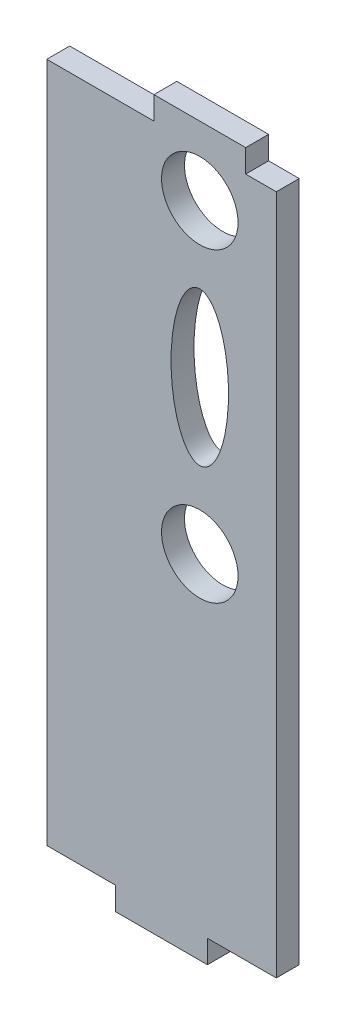
ISO-10303-21;
HEADER;
FILE_DESCRIPTION(('STEP AP214'),'2;1');
FILE_NAME('part.step','',(''),(''),'','','');
FILE_SCHEMA(('AUTOMOTIVE_DESIGN { 1 0 10303 214 1 1 1 1 }'));
ENDSEC;
DATA;
#1=APPLICATION_CONTEXT('core data for automotive mechanical design processes');
#2=APPLICATION_PROTOCOL_DEFINITION('international standard','automotive_design',2000,#1);
#3=PRODUCT_CONTEXT('',#1,'mechanical');
#4=PRODUCT('Part','Part','',(#3));
#5=PRODUCT_RELATED_PRODUCT_CATEGORY('part','',(#4));
#6=PRODUCT_DEFINITION_FORMATION('','',#4);
#7=PRODUCT_DEFINITION_CONTEXT('part definition',#1,'design');
#8=PRODUCT_DEFINITION('design','',#6,#7);
#9=PRODUCT_DEFINITION_SHAPE('','',#8);
#10=(LENGTH_UNIT() NAMED_UNIT(*) SI_UNIT(.MILLI.,.METRE.));
#11=(NAMED_UNIT(*) PLANE_ANGLE_UNIT() SI_UNIT($,.RADIAN.));
#12=(NAMED_UNIT(*) SI_UNIT($,.STERADIAN.) SOLID_ANGLE_UNIT());
#13=UNCERTAINTY_MEASURE_WITH_UNIT(LENGTH_MEASURE(1.E-05),#10,'distance_accuracy_value','');
#14=(GEOMETRIC_REPRESENTATION_CONTEXT(3) GLOBAL_UNCERTAINTY_ASSIGNED_CONTEXT((#13)) GLOBAL_UNIT_ASSIGNED_CONTEXT((#10,
#11,#12)) REPRESENTATION_CONTEXT('',''));
#15=CARTESIAN_POINT('',(0.,0.,0.));
#16=DIRECTION('',(0.,0.,1.));
#17=DIRECTION('',(1.,0.,0.));
#18=AXIS2_PLACEMENT_3D('',#15,#16,#17);
#19=CARTESIAN_POINT('',(0.,0.,3.));
#20=DIRECTION('',(0.,0.,1.));
#21=DIRECTION('',(1.,0.,0.));
#22=AXIS2_PLACEMENT_3D('',#19,#20,#21);
#23=PLANE('',#22);
#24=CARTESIAN_POINT('',(575.166453787392,349.688275275402,3.));
#25=DIRECTION('',(0.,0.,1.));
#26=DIRECTION('',(1.,0.,0.));
#27=AXIS2_PLACEMENT_3D('',#24,#25,#26);
#28=CIRCLE('',#27,5.00000000000005);
#29=CARTESIAN_POINT('',(580.166453787392,349.688275275402,3.));
#30=VERTEX_POINT('',#29);
#31=EDGE_CURVE('E283',#30,#30,#28,.T.);
#32=ORIENTED_EDGE('',*,*,#31,.F.);
#33=EDGE_LOOP('',(#32));
#34=FACE_BOUND('',#33,.T.);
#35=DIRECTION('',(-1.,0.,0.));
#36=VECTOR('',#35,1.);
#37=CARTESIAN_POINT('',(555.166453787392,395.688275275402,3.));
#38=LINE('',#37,#36);
#39=CARTESIAN_POINT('',(569.166453787392,395.688275275402,3.));
#40=VERTEX_POINT('',#39);
#41=CARTESIAN_POINT('',(555.166453787392,395.688275275402,3.));
#42=VERTEX_POINT('',#41);
#43=EDGE_CURVE('E179',#40,#42,#38,.T.);
#44=ORIENTED_EDGE('',*,*,#43,.T.);
#45=DIRECTION('',(0.,-1.,0.));
#46=VECTOR('',#45,1.);
#47=CARTESIAN_POINT('',(555.166453787392,395.688275275402,3.));
#48=LINE('',#47,#46);
#49=CARTESIAN_POINT('',(555.166453787392,306.688275275402,3.));
#50=VERTEX_POINT('',#49);
#51=EDGE_CURVE('E107',#42,#50,#48,.T.);
#52=ORIENTED_EDGE('',*,*,#51,.T.);
#53=DIRECTION('',(1.,0.,0.));
#54=VECTOR('',#53,1.);
#55=CARTESIAN_POINT('',(555.166453787392,306.688275275402,3.));
#56=LINE('',#55,#54);
#57=CARTESIAN_POINT('',(564.166453787392,306.688275275402,3.));
#58=VERTEX_POINT('',#57);
#59=EDGE_CURVE('E206',#50,#58,#56,.T.);
#60=ORIENTED_EDGE('',*,*,#59,.T.);
#61=DIRECTION('',(0.,-1.,0.));
#62=VECTOR('',#61,1.);
#63=CARTESIAN_POINT('',(564.166453787392,303.688275275402,3.));
#64=LINE('',#63,#62);
#65=CARTESIAN_POINT('',(564.166453787392,303.688275275402,3.));
#66=VERTEX_POINT('',#65);
#67=EDGE_CURVE('E225',#58,#66,#64,.T.);
#68=ORIENTED_EDGE('',*,*,#67,.T.);
#69=DIRECTION('',(1.,0.,0.));
#70=VECTOR('',#69,1.);
#71=CARTESIAN_POINT('',(564.166453787392,303.688275275402,3.));
#72=LINE('',#71,#70);
#73=CARTESIAN_POINT('',(576.166453787392,303.688275275402,3.));
#74=VERTEX_POINT('',#73);
#75=EDGE_CURVE('E222',#66,#74,#72,.T.);
#76=ORIENTED_EDGE('',*,*,#75,.T.);
#77=DIRECTION('',(0.,1.,0.));
#78=VECTOR('',#77,1.);
#79=CARTESIAN_POINT('',(576.166453787392,303.688275275402,3.));
#80=LINE('',#79,#78);
#81=CARTESIAN_POINT('',(576.166453787392,306.688275275402,3.));
#82=VERTEX_POINT('',#81);
#83=EDGE_CURVE('E224',#74,#82,#80,.T.);
#84=ORIENTED_EDGE('',*,*,#83,.T.);
#85=DIRECTION('',(1.,0.,0.));
#86=VECTOR('',#85,1.);
#87=CARTESIAN_POINT('',(576.166453787392,306.688275275402,3.));
#88=LINE('',#87,#86);
#89=CARTESIAN_POINT('',(585.166453787392,306.688275275402,3.));
#90=VERTEX_POINT('',#89);
#91=EDGE_CURVE('E227',#82,#90,#88,.T.);
#92=ORIENTED_EDGE('',*,*,#91,.T.);
#93=DIRECTION('',(0.,1.,0.));
#94=VECTOR('',#93,1.);
#95=CARTESIAN_POINT('',(585.166453787392,395.688275275402,3.));
#96=LINE('',#95,#94);
#97=CARTESIAN_POINT('',(585.166453787392,395.688275275402,3.));
#98=VERTEX_POINT('',#97);
#99=EDGE_CURVE('E233',#90,#98,#96,.T.);
#100=ORIENTED_EDGE('',*,*,#99,.T.);
#101=DIRECTION('',(-1.,0.,0.));
#102=VECTOR('',#101,1.);
#103=CARTESIAN_POINT('',(581.166453787392,395.688275275402,3.));
#104=LINE('',#103,#102);
#105=CARTESIAN_POINT('',(581.166453787392,395.688275275402,3.));
#106=VERTEX_POINT('',#105);
#107=EDGE_CURVE('E138',#98,#106,#104,.T.);
#108=ORIENTED_EDGE('',*,*,#107,.T.);
#109=DIRECTION('',(0.,1.,0.));
#110=VECTOR('',#109,1.);
#111=CARTESIAN_POINT('',(581.166453787392,395.688275275402,3.));
#112=LINE('',#111,#110);
#113=CARTESIAN_POINT('',(581.166453787392,398.688275275402,3.));
#114=VERTEX_POINT('',#113);
#115=EDGE_CURVE('E132',#106,#114,#112,.T.);
#116=ORIENTED_EDGE('',*,*,#115,.T.);
#117=DIRECTION('',(-1.,0.,0.));
#118=VECTOR('',#117,1.);
#119=CARTESIAN_POINT('',(569.166453787392,398.688275275402,3.));
#120=LINE('',#119,#118);
#121=CARTESIAN_POINT('',(569.166453787392,398.688275275402,3.));
#122=VERTEX_POINT('',#121);
#123=EDGE_CURVE('E136',#114,#122,#120,.T.);
#124=ORIENTED_EDGE('',*,*,#123,.T.);
#125=DIRECTION('',(0.,-1.,0.));
#126=VECTOR('',#125,1.);
#127=CARTESIAN_POINT('',(569.166453787392,395.688275275402,3.));
#128=LINE('',#127,#126);
#129=EDGE_CURVE('E52',#122,#40,#128,.T.);
#130=ORIENTED_EDGE('',*,*,#129,.T.);
#131=EDGE_LOOP('',(#44,#52,#60,#68,#76,#84,#92,#100,#108,#116,#124,#130));
#132=FACE_BOUND('',#131,.T.);
#133=CARTESIAN_POINT('',(575.166453787392,389.688275275402,3.));
#134=DIRECTION('',(0.,0.,1.));
#135=DIRECTION('',(1.,0.,0.));
#136=AXIS2_PLACEMENT_3D('',#133,#134,#135);
#137=CIRCLE('',#136,5.00000000000005);
#138=CARTESIAN_POINT('',(580.166453787392,389.688275275402,3.));
#139=VERTEX_POINT('',#138);
#140=EDGE_CURVE('E160',#139,#139,#137,.T.);
#141=ORIENTED_EDGE('',*,*,#140,.F.);
#142=EDGE_LOOP('',(#141));
#143=FACE_BOUND('',#142,.T.);
#144=CARTESIAN_POINT('',(575.166453787392,369.688275275402,3.));
#145=DIRECTION('',(0.,0.,1.));
#146=DIRECTION('',(0.,1.,0.));
#147=AXIS2_PLACEMENT_3D('',#144,#145,#146);
#148=ELLIPSE('',#147,10.,3.75705207890109);
#149=CARTESIAN_POINT('',(575.166453787392,379.688275275402,3.));
#150=VERTEX_POINT('',#149);
#151=EDGE_CURVE('E275',#150,#150,#148,.T.);
#152=ORIENTED_EDGE('',*,*,#151,.F.);
#153=EDGE_LOOP('',(#152));
#154=FACE_BOUND('',#153,.T.);
#155=ADVANCED_FACE('F35',(#34,#132,#143,#154),#23,.T.);
#156=CARTESIAN_POINT('',(0.,0.,0.));
#157=DIRECTION('',(0.,0.,1.));
#158=DIRECTION('',(1.,0.,0.));
#159=AXIS2_PLACEMENT_3D('',#156,#157,#158);
#160=PLANE('',#159);
#161=DIRECTION('',(-1.,0.,0.));
#162=VECTOR('',#161,1.);
#163=CARTESIAN_POINT('',(555.166453787392,395.688275275402,0.));
#164=LINE('',#163,#162);
#165=CARTESIAN_POINT('',(569.166453787392,395.688275275402,0.));
#166=VERTEX_POINT('',#165);
#167=CARTESIAN_POINT('',(555.166453787392,395.688275275402,0.));
#168=VERTEX_POINT('',#167);
#169=EDGE_CURVE('E156',#166,#168,#164,.T.);
#170=ORIENTED_EDGE('',*,*,#169,.F.);
#171=DIRECTION('',(0.,-1.,0.));
#172=VECTOR('',#171,1.);
#173=CARTESIAN_POINT('',(569.166453787392,395.688275275402,0.));
#174=LINE('',#173,#172);
#175=CARTESIAN_POINT('',(569.166453787392,398.688275275402,0.));
#176=VERTEX_POINT('',#175);
#177=EDGE_CURVE('E99',#176,#166,#174,.T.);
#178=ORIENTED_EDGE('',*,*,#177,.F.);
#179=DIRECTION('',(-1.,0.,0.));
#180=VECTOR('',#179,1.);
#181=CARTESIAN_POINT('',(569.166453787392,398.688275275402,0.));
#182=LINE('',#181,#180);
#183=CARTESIAN_POINT('',(581.166453787392,398.688275275402,0.));
#184=VERTEX_POINT('',#183);
#185=EDGE_CURVE('E93',#184,#176,#182,.T.);
#186=ORIENTED_EDGE('',*,*,#185,.F.);
#187=DIRECTION('',(0.,1.,0.));
#188=VECTOR('',#187,1.);
#189=CARTESIAN_POINT('',(581.166453787392,395.688275275402,0.));
#190=LINE('',#189,#188);
#191=CARTESIAN_POINT('',(581.166453787392,395.688275275402,0.));
#192=VERTEX_POINT('',#191);
#193=EDGE_CURVE('E146',#192,#184,#190,.T.);
#194=ORIENTED_EDGE('',*,*,#193,.F.);
#195=DIRECTION('',(-1.,0.,0.));
#196=VECTOR('',#195,1.);
#197=CARTESIAN_POINT('',(581.166453787392,395.688275275402,0.));
#198=LINE('',#197,#196);
#199=CARTESIAN_POINT('',(585.166453787392,395.688275275402,0.));
#200=VERTEX_POINT('',#199);
#201=EDGE_CURVE('E174',#200,#192,#198,.T.);
#202=ORIENTED_EDGE('',*,*,#201,.F.);
#203=DIRECTION('',(0.,1.,0.));
#204=VECTOR('',#203,1.);
#205=CARTESIAN_POINT('',(585.166453787392,395.688275275402,0.));
#206=LINE('',#205,#204);
#207=CARTESIAN_POINT('',(585.166453787392,306.688275275402,0.));
#208=VERTEX_POINT('',#207);
#209=EDGE_CURVE('E172',#208,#200,#206,.T.);
#210=ORIENTED_EDGE('',*,*,#209,.F.);
#211=DIRECTION('',(1.,0.,0.));
#212=VECTOR('',#211,1.);
#213=CARTESIAN_POINT('',(576.166453787392,306.688275275402,0.));
#214=LINE('',#213,#212);
#215=CARTESIAN_POINT('',(576.166453787392,306.688275275402,0.));
#216=VERTEX_POINT('',#215);
#217=EDGE_CURVE('E170',#216,#208,#214,.T.);
#218=ORIENTED_EDGE('',*,*,#217,.F.);
#219=DIRECTION('',(0.,1.,0.));
#220=VECTOR('',#219,1.);
#221=CARTESIAN_POINT('',(576.166453787392,303.688275275402,0.));
#222=LINE('',#221,#220);
#223=CARTESIAN_POINT('',(576.166453787392,303.688275275402,0.));
#224=VERTEX_POINT('',#223);
#225=EDGE_CURVE('E168',#224,#216,#222,.T.);
#226=ORIENTED_EDGE('',*,*,#225,.F.);
#227=DIRECTION('',(1.,0.,0.));
#228=VECTOR('',#227,1.);
#229=CARTESIAN_POINT('',(564.166453787392,303.688275275402,0.));
#230=LINE('',#229,#228);
#231=CARTESIAN_POINT('',(564.166453787392,303.688275275402,0.));
#232=VERTEX_POINT('',#231);
#233=EDGE_CURVE('E166',#232,#224,#230,.T.);
#234=ORIENTED_EDGE('',*,*,#233,.F.);
#235=DIRECTION('',(0.,-1.,0.));
#236=VECTOR('',#235,1.);
#237=CARTESIAN_POINT('',(564.166453787392,303.688275275402,0.));
#238=LINE('',#237,#236);
#239=CARTESIAN_POINT('',(564.166453787392,306.688275275402,0.));
#240=VERTEX_POINT('',#239);
#241=EDGE_CURVE('E164',#240,#232,#238,.T.);
#242=ORIENTED_EDGE('',*,*,#241,.F.);
#243=DIRECTION('',(1.,0.,0.));
#244=VECTOR('',#243,1.);
#245=CARTESIAN_POINT('',(555.166453787392,306.688275275402,0.));
#246=LINE('',#245,#244);
#247=CARTESIAN_POINT('',(555.166453787392,306.688275275402,0.));
#248=VERTEX_POINT('',#247);
#249=EDGE_CURVE('E162',#248,#240,#246,.T.);
#250=ORIENTED_EDGE('',*,*,#249,.F.);
#251=DIRECTION('',(0.,-1.,0.));
#252=VECTOR('',#251,1.);
#253=CARTESIAN_POINT('',(555.166453787392,395.688275275402,0.));
#254=LINE('',#253,#252);
#255=EDGE_CURVE('E159',#168,#248,#254,.T.);
#256=ORIENTED_EDGE('',*,*,#255,.F.);
#257=EDGE_LOOP('',(#170,#178,#186,#194,#202,#210,#218,#226,#234,#242,#250,#256));
#258=FACE_BOUND('',#257,.T.);
#259=CARTESIAN_POINT('',(575.166453787392,389.688275275402,0.));
#260=DIRECTION('',(0.,0.,1.));
#261=DIRECTION('',(1.,0.,0.));
#262=AXIS2_PLACEMENT_3D('',#259,#260,#261);
#263=CIRCLE('',#262,5.00000000000005);
#264=CARTESIAN_POINT('',(580.166453787392,389.688275275402,0.));
#265=VERTEX_POINT('',#264);
#266=EDGE_CURVE('E286',#265,#265,#263,.T.);
#267=ORIENTED_EDGE('',*,*,#266,.T.);
#268=EDGE_LOOP('',(#267));
#269=FACE_BOUND('',#268,.T.);
#270=CARTESIAN_POINT('',(575.166453787392,349.688275275402,0.));
#271=DIRECTION('',(0.,0.,1.));
#272=DIRECTION('',(1.,0.,0.));
#273=AXIS2_PLACEMENT_3D('',#270,#271,#272);
#274=CIRCLE('',#273,5.00000000000005);
#275=CARTESIAN_POINT('',(580.166453787392,349.688275275402,0.));
#276=VERTEX_POINT('',#275);
#277=EDGE_CURVE('E279',#276,#276,#274,.T.);
#278=ORIENTED_EDGE('',*,*,#277,.T.);
#279=EDGE_LOOP('',(#278));
#280=FACE_BOUND('',#279,.T.);
#281=CARTESIAN_POINT('',(575.166453787392,369.688275275402,0.));
#282=DIRECTION('',(0.,0.,1.));
#283=DIRECTION('',(0.,1.,0.));
#284=AXIS2_PLACEMENT_3D('',#281,#282,#283);
#285=ELLIPSE('',#284,10.,3.75705207890109);
#286=CARTESIAN_POINT('',(575.166453787392,379.688275275402,0.));
#287=VERTEX_POINT('',#286);
#288=EDGE_CURVE('E280',#287,#287,#285,.T.);
#289=ORIENTED_EDGE('',*,*,#288,.T.);
#290=EDGE_LOOP('',(#289));
#291=FACE_BOUND('',#290,.T.);
#292=ADVANCED_FACE('F210',(#258,#269,#280,#291),#160,.F.);
#293=CARTESIAN_POINT('',(555.166453787392,395.688275275402,3.));
#294=DIRECTION('',(0.,-1.,0.));
#295=DIRECTION('',(0.,0.,-1.));
#296=AXIS2_PLACEMENT_3D('',#293,#294,#295);
#297=PLANE('',#296);
#298=ORIENTED_EDGE('',*,*,#169,.T.);
#299=DIRECTION('',(0.,0.,-1.));
#300=VECTOR('',#299,1.);
#301=CARTESIAN_POINT('',(555.166453787392,395.688275275402,3.));
#302=LINE('',#301,#300);
#303=EDGE_CURVE('E11',#42,#168,#302,.T.);
#304=ORIENTED_EDGE('',*,*,#303,.F.);
#305=ORIENTED_EDGE('',*,*,#43,.F.);
#306=DIRECTION('',(0.,0.,-1.));
#307=VECTOR('',#306,1.);
#308=CARTESIAN_POINT('',(569.166453787392,395.688275275402,3.));
#309=LINE('',#308,#307);
#310=EDGE_CURVE('E152',#40,#166,#309,.T.);
#311=ORIENTED_EDGE('',*,*,#310,.T.);
#312=EDGE_LOOP('',(#298,#304,#305,#311));
#313=FACE_BOUND('',#312,.T.);
#314=ADVANCED_FACE('F37',(#313),#297,.F.);
#315=CARTESIAN_POINT('',(555.166453787392,395.688275275402,3.));
#316=DIRECTION('',(1.,0.,0.));
#317=DIRECTION('',(0.,0.,-1.));
#318=AXIS2_PLACEMENT_3D('',#315,#316,#317);
#319=PLANE('',#318);
#320=ORIENTED_EDGE('',*,*,#255,.T.);
#321=DIRECTION('',(0.,0.,-1.));
#322=VECTOR('',#321,1.);
#323=CARTESIAN_POINT('',(555.166453787392,306.688275275402,3.));
#324=LINE('',#323,#322);
#325=EDGE_CURVE('E44',#50,#248,#324,.T.);
#326=ORIENTED_EDGE('',*,*,#325,.F.);
#327=ORIENTED_EDGE('',*,*,#51,.F.);
#328=ORIENTED_EDGE('',*,*,#303,.T.);
#329=EDGE_LOOP('',(#320,#326,#327,#328));
#330=FACE_BOUND('',#329,.T.);
#331=ADVANCED_FACE('F394',(#330),#319,.F.);
#332=CARTESIAN_POINT('',(555.166453787392,306.688275275402,3.));
#333=DIRECTION('',(0.,1.,0.));
#334=DIRECTION('',(0.,0.,1.));
#335=AXIS2_PLACEMENT_3D('',#332,#333,#334);
#336=PLANE('',#335);
#337=ORIENTED_EDGE('',*,*,#249,.T.);
#338=DIRECTION('',(0.,0.,-1.));
#339=VECTOR('',#338,1.);
#340=CARTESIAN_POINT('',(564.166453787392,306.688275275402,3.));
#341=LINE('',#340,#339);
#342=EDGE_CURVE('E198',#58,#240,#341,.T.);
#343=ORIENTED_EDGE('',*,*,#342,.F.);
#344=ORIENTED_EDGE('',*,*,#59,.F.);
#345=ORIENTED_EDGE('',*,*,#325,.T.);
#346=EDGE_LOOP('',(#337,#343,#344,#345));
#347=FACE_BOUND('',#346,.T.);
#348=ADVANCED_FACE('F204',(#347),#336,.F.);
#349=CARTESIAN_POINT('',(564.166453787392,303.688275275402,3.));
#350=DIRECTION('',(1.,0.,0.));
#351=DIRECTION('',(0.,0.,-1.));
#352=AXIS2_PLACEMENT_3D('',#349,#350,#351);
#353=PLANE('',#352);
#354=ORIENTED_EDGE('',*,*,#241,.T.);
#355=DIRECTION('',(0.,0.,-1.));
#356=VECTOR('',#355,1.);
#357=CARTESIAN_POINT('',(564.166453787392,303.688275275402,3.));
#358=LINE('',#357,#356);
#359=EDGE_CURVE('E195',#66,#232,#358,.T.);
#360=ORIENTED_EDGE('',*,*,#359,.F.);
#361=ORIENTED_EDGE('',*,*,#67,.F.);
#362=ORIENTED_EDGE('',*,*,#342,.T.);
#363=EDGE_LOOP('',(#354,#360,#361,#362));
#364=FACE_BOUND('',#363,.T.);
#365=ADVANCED_FACE('F216',(#364),#353,.F.);
#366=CARTESIAN_POINT('',(564.166453787392,303.688275275402,3.));
#367=DIRECTION('',(0.,1.,0.));
#368=DIRECTION('',(0.,0.,1.));
#369=AXIS2_PLACEMENT_3D('',#366,#367,#368);
#370=PLANE('',#369);
#371=ORIENTED_EDGE('',*,*,#233,.T.);
#372=DIRECTION('',(0.,0.,-1.));
#373=VECTOR('',#372,1.);
#374=CARTESIAN_POINT('',(576.166453787392,303.688275275402,3.));
#375=LINE('',#374,#373);
#376=EDGE_CURVE('E192',#74,#224,#375,.T.);
#377=ORIENTED_EDGE('',*,*,#376,.F.);
#378=ORIENTED_EDGE('',*,*,#75,.F.);
#379=ORIENTED_EDGE('',*,*,#359,.T.);
#380=EDGE_LOOP('',(#371,#377,#378,#379));
#381=FACE_BOUND('',#380,.T.);
#382=ADVANCED_FACE('F220',(#381),#370,.F.);
#383=CARTESIAN_POINT('',(576.166453787392,303.688275275402,3.));
#384=DIRECTION('',(-1.,0.,0.));
#385=DIRECTION('',(0.,0.,1.));
#386=AXIS2_PLACEMENT_3D('',#383,#384,#385);
#387=PLANE('',#386);
#388=ORIENTED_EDGE('',*,*,#225,.T.);
#389=DIRECTION('',(0.,0.,-1.));
#390=VECTOR('',#389,1.);
#391=CARTESIAN_POINT('',(576.166453787392,306.688275275402,3.));
#392=LINE('',#391,#390);
#393=EDGE_CURVE('E189',#82,#216,#392,.T.);
#394=ORIENTED_EDGE('',*,*,#393,.F.);
#395=ORIENTED_EDGE('',*,*,#83,.F.);
#396=ORIENTED_EDGE('',*,*,#376,.T.);
#397=EDGE_LOOP('',(#388,#394,#395,#396));
#398=FACE_BOUND('',#397,.T.);
#399=ADVANCED_FACE('F359',(#398),#387,.F.);
#400=CARTESIAN_POINT('',(576.166453787392,306.688275275402,3.));
#401=DIRECTION('',(0.,1.,0.));
#402=DIRECTION('',(0.,0.,1.));
#403=AXIS2_PLACEMENT_3D('',#400,#401,#402);
#404=PLANE('',#403);
#405=ORIENTED_EDGE('',*,*,#217,.T.);
#406=DIRECTION('',(0.,0.,-1.));
#407=VECTOR('',#406,1.);
#408=CARTESIAN_POINT('',(585.166453787392,306.688275275402,3.));
#409=LINE('',#408,#407);
#410=EDGE_CURVE('E186',#90,#208,#409,.T.);
#411=ORIENTED_EDGE('',*,*,#410,.F.);
#412=ORIENTED_EDGE('',*,*,#91,.F.);
#413=ORIENTED_EDGE('',*,*,#393,.T.);
#414=EDGE_LOOP('',(#405,#411,#412,#413));
#415=FACE_BOUND('',#414,.T.);
#416=ADVANCED_FACE('F350',(#415),#404,.F.);
#417=CARTESIAN_POINT('',(585.166453787392,395.688275275402,3.));
#418=DIRECTION('',(-1.,0.,0.));
#419=DIRECTION('',(0.,-1.,0.));
#420=AXIS2_PLACEMENT_3D('',#417,#418,#419);
#421=PLANE('',#420);
#422=ORIENTED_EDGE('',*,*,#209,.T.);
#423=DIRECTION('',(0.,0.,-1.));
#424=VECTOR('',#423,1.);
#425=CARTESIAN_POINT('',(585.166453787392,395.688275275402,3.));
#426=LINE('',#425,#424);
#427=EDGE_CURVE('E183',#98,#200,#426,.T.);
#428=ORIENTED_EDGE('',*,*,#427,.F.);
#429=ORIENTED_EDGE('',*,*,#99,.F.);
#430=ORIENTED_EDGE('',*,*,#410,.T.);
#431=EDGE_LOOP('',(#422,#428,#429,#430));
#432=FACE_BOUND('',#431,.T.);
#433=ADVANCED_FACE('F239',(#432),#421,.F.);
#434=CARTESIAN_POINT('',(581.166453787392,395.688275275402,3.));
#435=DIRECTION('',(0.,-1.,0.));
#436=DIRECTION('',(0.,0.,-1.));
#437=AXIS2_PLACEMENT_3D('',#434,#435,#436);
#438=PLANE('',#437);
#439=ORIENTED_EDGE('',*,*,#201,.T.);
#440=DIRECTION('',(0.,0.,-1.));
#441=VECTOR('',#440,1.);
#442=CARTESIAN_POINT('',(581.166453787392,395.688275275402,3.));
#443=LINE('',#442,#441);
#444=EDGE_CURVE('E147',#106,#192,#443,.T.);
#445=ORIENTED_EDGE('',*,*,#444,.F.);
#446=ORIENTED_EDGE('',*,*,#107,.F.);
#447=ORIENTED_EDGE('',*,*,#427,.T.);
#448=EDGE_LOOP('',(#439,#445,#446,#447));
#449=FACE_BOUND('',#448,.T.);
#450=ADVANCED_FACE('F243',(#449),#438,.F.);
#451=CARTESIAN_POINT('',(581.166453787392,395.688275275402,3.));
#452=DIRECTION('',(-1.,0.,0.));
#453=DIRECTION('',(0.,0.,1.));
#454=AXIS2_PLACEMENT_3D('',#451,#452,#453);
#455=PLANE('',#454);
#456=ORIENTED_EDGE('',*,*,#193,.T.);
#457=DIRECTION('',(0.,0.,-1.));
#458=VECTOR('',#457,1.);
#459=CARTESIAN_POINT('',(581.166453787392,398.688275275402,3.));
#460=LINE('',#459,#458);
#461=EDGE_CURVE('E143',#114,#184,#460,.T.);
#462=ORIENTED_EDGE('',*,*,#461,.F.);
#463=ORIENTED_EDGE('',*,*,#115,.F.);
#464=ORIENTED_EDGE('',*,*,#444,.T.);
#465=EDGE_LOOP('',(#456,#462,#463,#464));
#466=FACE_BOUND('',#465,.T.);
#467=ADVANCED_FACE('F144',(#466),#455,.F.);
#468=CARTESIAN_POINT('',(569.166453787392,398.688275275402,3.));
#469=DIRECTION('',(0.,-1.,0.));
#470=DIRECTION('',(0.,0.,-1.));
#471=AXIS2_PLACEMENT_3D('',#468,#469,#470);
#472=PLANE('',#471);
#473=ORIENTED_EDGE('',*,*,#185,.T.);
#474=DIRECTION('',(0.,0.,-1.));
#475=VECTOR('',#474,1.);
#476=CARTESIAN_POINT('',(569.166453787392,398.688275275402,3.));
#477=LINE('',#476,#475);
#478=EDGE_CURVE('E148',#122,#176,#477,.T.);
#479=ORIENTED_EDGE('',*,*,#478,.F.);
#480=ORIENTED_EDGE('',*,*,#123,.F.);
#481=ORIENTED_EDGE('',*,*,#461,.T.);
#482=EDGE_LOOP('',(#473,#479,#480,#481));
#483=FACE_BOUND('',#482,.T.);
#484=ADVANCED_FACE('F150',(#483),#472,.F.);
#485=CARTESIAN_POINT('',(569.166453787392,395.688275275402,3.));
#486=DIRECTION('',(1.,0.,0.));
#487=DIRECTION('',(0.,0.,-1.));
#488=AXIS2_PLACEMENT_3D('',#485,#486,#487);
#489=PLANE('',#488);
#490=ORIENTED_EDGE('',*,*,#177,.T.);
#491=ORIENTED_EDGE('',*,*,#310,.F.);
#492=ORIENTED_EDGE('',*,*,#129,.F.);
#493=ORIENTED_EDGE('',*,*,#478,.T.);
#494=EDGE_LOOP('',(#490,#491,#492,#493));
#495=FACE_BOUND('',#494,.T.);
#496=ADVANCED_FACE('F247',(#495),#489,.F.);
#497=CARTESIAN_POINT('',(575.166453787392,389.688275275402,3.));
#498=DIRECTION('',(0.,0.,-1.));
#499=DIRECTION('',(-1.,0.,0.));
#500=AXIS2_PLACEMENT_3D('',#497,#498,#499);
#501=CYLINDRICAL_SURFACE('',#500,5.00000000000005);
#502=ORIENTED_EDGE('',*,*,#140,.T.);
#503=EDGE_LOOP('',(#502));
#504=FACE_BOUND('',#503,.T.);
#505=ORIENTED_EDGE('',*,*,#266,.F.);
#506=EDGE_LOOP('',(#505));
#507=FACE_BOUND('',#506,.T.);
#508=ADVANCED_FACE('F249',(#504,#507),#501,.F.);
#509=CARTESIAN_POINT('',(575.166453787392,349.688275275402,3.));
#510=DIRECTION('',(0.,0.,-1.));
#511=DIRECTION('',(-1.,0.,0.));
#512=AXIS2_PLACEMENT_3D('',#509,#510,#511);
#513=CYLINDRICAL_SURFACE('',#512,5.00000000000005);
#514=ORIENTED_EDGE('',*,*,#31,.T.);
#515=EDGE_LOOP('',(#514));
#516=FACE_BOUND('',#515,.T.);
#517=ORIENTED_EDGE('',*,*,#277,.F.);
#518=EDGE_LOOP('',(#517));
#519=FACE_BOUND('',#518,.T.);
#520=ADVANCED_FACE('F255',(#516,#519),#513,.F.);
#521=DIRECTION('',(0.,0.,-1.));
#522=VECTOR('',#521,1.);
#523=SURFACE_OF_LINEAR_EXTRUSION('',#148,#522);
#524=ORIENTED_EDGE('',*,*,#151,.T.);
#525=EDGE_LOOP('',(#524));
#526=FACE_BOUND('',#525,.T.);
#527=ORIENTED_EDGE('',*,*,#288,.F.);
#528=EDGE_LOOP('',(#527));
#529=FACE_BOUND('',#528,.T.);
#530=ADVANCED_FACE('F270',(#526,#529),#523,.T.);
#531=CLOSED_SHELL('',(#155,#292,#314,#331,#348,#365,#382,#399,#416,#433,#450,#467,#484,#496,
#508,#520,#530));
#532=MANIFOLD_SOLID_BREP('B2',#531);
#533=ADVANCED_BREP_SHAPE_REPRESENTATION('',(#18,#532),#14);
#534=SHAPE_DEFINITION_REPRESENTATION(#9,#533);
ENDSEC;
END-ISO-10303-21;
